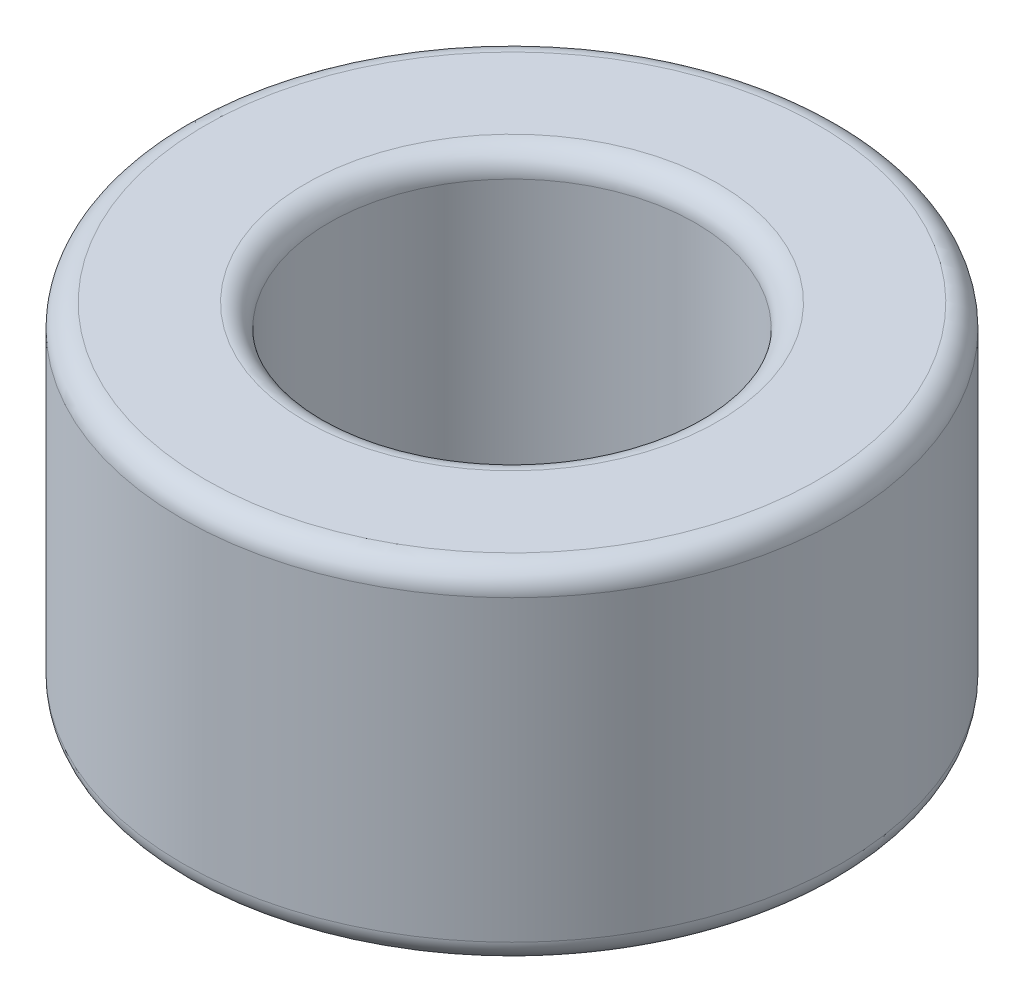
ISO-10303-21;
HEADER;
FILE_DESCRIPTION(('STEP AP214'),'2;1');
FILE_NAME('part.step','',(''),(''),'','','');
FILE_SCHEMA(('AUTOMOTIVE_DESIGN { 1 0 10303 214 1 1 1 1 }'));
ENDSEC;
DATA;
#1=APPLICATION_CONTEXT('core data for automotive mechanical design processes');
#2=APPLICATION_PROTOCOL_DEFINITION('international standard','automotive_design',2000,#1);
#3=PRODUCT_CONTEXT('',#1,'mechanical');
#4=PRODUCT('Part','Part','',(#3));
#5=PRODUCT_RELATED_PRODUCT_CATEGORY('part','',(#4));
#6=PRODUCT_DEFINITION_FORMATION('','',#4);
#7=PRODUCT_DEFINITION_CONTEXT('part definition',#1,'design');
#8=PRODUCT_DEFINITION('design','',#6,#7);
#9=PRODUCT_DEFINITION_SHAPE('','',#8);
#10=(LENGTH_UNIT() NAMED_UNIT(*) SI_UNIT(.MILLI.,.METRE.));
#11=(NAMED_UNIT(*) PLANE_ANGLE_UNIT() SI_UNIT($,.RADIAN.));
#12=(NAMED_UNIT(*) SI_UNIT($,.STERADIAN.) SOLID_ANGLE_UNIT());
#13=UNCERTAINTY_MEASURE_WITH_UNIT(LENGTH_MEASURE(1.E-05),#10,'distance_accuracy_value','');
#14=(GEOMETRIC_REPRESENTATION_CONTEXT(3) GLOBAL_UNCERTAINTY_ASSIGNED_CONTEXT((#13)) GLOBAL_UNIT_ASSIGNED_CONTEXT((#10,
#11,#12)) REPRESENTATION_CONTEXT('',''));
#15=CARTESIAN_POINT('',(0.,0.,0.));
#16=DIRECTION('',(0.,0.,1.));
#17=DIRECTION('',(1.,0.,0.));
#18=AXIS2_PLACEMENT_3D('',#15,#16,#17);
#19=CARTESIAN_POINT('',(0.,3.,0.));
#20=DIRECTION('',(0.,1.,0.));
#21=DIRECTION('',(0.,0.,1.));
#22=AXIS2_PLACEMENT_3D('',#19,#20,#21);
#23=PLANE('',#22);
#24=CARTESIAN_POINT('',(0.,3.,0.));
#25=DIRECTION('',(0.,1.,0.));
#26=DIRECTION('',(0.,0.,1.));
#27=AXIS2_PLACEMENT_3D('',#24,#25,#26);
#28=CIRCLE('',#27,1.7984375);
#29=CARTESIAN_POINT('',(0.,3.,1.7984375));
#30=VERTEX_POINT('',#29);
#31=EDGE_CURVE('E10',#30,#30,#28,.F.);
#32=ORIENTED_EDGE('',*,*,#31,.T.);
#33=EDGE_LOOP('',(#32));
#34=FACE_BOUND('',#33,.T.);
#35=CARTESIAN_POINT('',(0.,3.,0.));
#36=DIRECTION('',(0.,1.,0.));
#37=DIRECTION('',(0.,0.,1.));
#38=AXIS2_PLACEMENT_3D('',#35,#36,#37);
#39=CIRCLE('',#38,2.67656249999996);
#40=CARTESIAN_POINT('',(0.,3.,2.67656249999996));
#41=VERTEX_POINT('',#40);
#42=EDGE_CURVE('E47',#41,#41,#39,.T.);
#43=ORIENTED_EDGE('',*,*,#42,.T.);
#44=EDGE_LOOP('',(#43));
#45=FACE_BOUND('',#44,.T.);
#46=ADVANCED_FACE('F39',(#34,#45),#23,.T.);
#47=CARTESIAN_POINT('',(0.,0.,0.));
#48=DIRECTION('',(0.,1.,0.));
#49=DIRECTION('',(0.,0.,1.));
#50=AXIS2_PLACEMENT_3D('',#47,#48,#49);
#51=PLANE('',#50);
#52=CARTESIAN_POINT('',(0.,0.,0.));
#53=DIRECTION('',(0.,1.,0.));
#54=DIRECTION('',(0.,0.,1.));
#55=AXIS2_PLACEMENT_3D('',#52,#53,#54);
#56=CIRCLE('',#55,1.7984375);
#57=CARTESIAN_POINT('',(0.,0.,1.7984375));
#58=VERTEX_POINT('',#57);
#59=EDGE_CURVE('E72',#58,#58,#56,.T.);
#60=ORIENTED_EDGE('',*,*,#59,.T.);
#61=EDGE_LOOP('',(#60));
#62=FACE_BOUND('',#61,.T.);
#63=CARTESIAN_POINT('',(0.,0.,0.));
#64=DIRECTION('',(0.,1.,0.));
#65=DIRECTION('',(0.,0.,1.));
#66=AXIS2_PLACEMENT_3D('',#63,#64,#65);
#67=CIRCLE('',#66,2.67656249999996);
#68=CARTESIAN_POINT('',(0.,0.,2.67656249999996));
#69=VERTEX_POINT('',#68);
#70=EDGE_CURVE('E76',#69,#69,#67,.F.);
#71=ORIENTED_EDGE('',*,*,#70,.T.);
#72=EDGE_LOOP('',(#71));
#73=FACE_BOUND('',#72,.T.);
#74=ADVANCED_FACE('F80',(#62,#73),#51,.F.);
#75=CARTESIAN_POINT('',(0.,3.,0.));
#76=DIRECTION('',(0.,-1.,0.));
#77=DIRECTION('',(0.,0.,-1.));
#78=AXIS2_PLACEMENT_3D('',#75,#76,#77);
#79=CYLINDRICAL_SURFACE('',#78,2.87499999999996);
#80=CARTESIAN_POINT('',(0.,0.1984375,0.));
#81=DIRECTION('',(0.,1.,0.));
#82=DIRECTION('',(0.,0.,1.));
#83=AXIS2_PLACEMENT_3D('',#80,#81,#82);
#84=CIRCLE('',#83,2.87499999999996);
#85=CARTESIAN_POINT('',(0.,0.1984375,2.87499999999996));
#86=VERTEX_POINT('',#85);
#87=EDGE_CURVE('E54',#86,#86,#84,.T.);
#88=ORIENTED_EDGE('',*,*,#87,.T.);
#89=EDGE_LOOP('',(#88));
#90=FACE_BOUND('',#89,.T.);
#91=CARTESIAN_POINT('',(0.,2.8015625,0.));
#92=DIRECTION('',(0.,1.,0.));
#93=DIRECTION('',(0.,0.,1.));
#94=AXIS2_PLACEMENT_3D('',#91,#92,#93);
#95=CIRCLE('',#94,2.87499999999996);
#96=CARTESIAN_POINT('',(0.,2.8015625,2.87499999999996));
#97=VERTEX_POINT('',#96);
#98=EDGE_CURVE('E60',#97,#97,#95,.F.);
#99=ORIENTED_EDGE('',*,*,#98,.T.);
#100=EDGE_LOOP('',(#99));
#101=FACE_BOUND('',#100,.T.);
#102=ADVANCED_FACE('F90',(#90,#101),#79,.T.);
#103=CARTESIAN_POINT('',(0.,3.,0.));
#104=DIRECTION('',(0.,-1.,0.));
#105=DIRECTION('',(0.,0.,-1.));
#106=AXIS2_PLACEMENT_3D('',#103,#104,#105);
#107=CYLINDRICAL_SURFACE('',#106,1.6);
#108=CARTESIAN_POINT('',(0.,0.1984375,0.));
#109=DIRECTION('',(0.,1.,0.));
#110=DIRECTION('',(0.,0.,1.));
#111=AXIS2_PLACEMENT_3D('',#108,#109,#110);
#112=CIRCLE('',#111,1.6);
#113=CARTESIAN_POINT('',(0.,0.1984375,1.6));
#114=VERTEX_POINT('',#113);
#115=EDGE_CURVE('E65',#114,#114,#112,.F.);
#116=ORIENTED_EDGE('',*,*,#115,.T.);
#117=EDGE_LOOP('',(#116));
#118=FACE_BOUND('',#117,.T.);
#119=CARTESIAN_POINT('',(0.,2.8015625,0.));
#120=DIRECTION('',(0.,1.,0.));
#121=DIRECTION('',(0.,0.,1.));
#122=AXIS2_PLACEMENT_3D('',#119,#120,#121);
#123=CIRCLE('',#122,1.6);
#124=CARTESIAN_POINT('',(0.,2.8015625,1.6));
#125=VERTEX_POINT('',#124);
#126=EDGE_CURVE('E69',#125,#125,#123,.T.);
#127=ORIENTED_EDGE('',*,*,#126,.T.);
#128=EDGE_LOOP('',(#127));
#129=FACE_BOUND('',#128,.T.);
#130=ADVANCED_FACE('F93',(#118,#129),#107,.F.);
#131=CARTESIAN_POINT('',(0.,0.1984375,0.));
#132=DIRECTION('',(0.,1.,0.));
#133=DIRECTION('',(0.,0.,1.));
#134=AXIS2_PLACEMENT_3D('',#131,#132,#133);
#135=TOROIDAL_SURFACE('',#134,1.7984375,0.1984375);
#136=ORIENTED_EDGE('',*,*,#115,.F.);
#137=EDGE_LOOP('',(#136));
#138=FACE_BOUND('',#137,.T.);
#139=ORIENTED_EDGE('',*,*,#59,.F.);
#140=EDGE_LOOP('',(#139));
#141=FACE_BOUND('',#140,.T.);
#142=ADVANCED_FACE('F86',(#138,#141),#135,.T.);
#143=CARTESIAN_POINT('',(0.,0.1984375,0.));
#144=DIRECTION('',(0.,1.,0.));
#145=DIRECTION('',(0.,0.,1.));
#146=AXIS2_PLACEMENT_3D('',#143,#144,#145);
#147=TOROIDAL_SURFACE('',#146,2.67656249999996,0.1984375);
#148=ORIENTED_EDGE('',*,*,#70,.F.);
#149=EDGE_LOOP('',(#148));
#150=FACE_BOUND('',#149,.T.);
#151=ORIENTED_EDGE('',*,*,#87,.F.);
#152=EDGE_LOOP('',(#151));
#153=FACE_BOUND('',#152,.T.);
#154=ADVANCED_FACE('F82',(#150,#153),#147,.T.);
#155=CARTESIAN_POINT('',(0.,2.8015625,0.));
#156=DIRECTION('',(0.,1.,0.));
#157=DIRECTION('',(0.,0.,1.));
#158=AXIS2_PLACEMENT_3D('',#155,#156,#157);
#159=TOROIDAL_SURFACE('',#158,1.7984375,0.1984375);
#160=ORIENTED_EDGE('',*,*,#31,.F.);
#161=EDGE_LOOP('',(#160));
#162=FACE_BOUND('',#161,.T.);
#163=ORIENTED_EDGE('',*,*,#126,.F.);
#164=EDGE_LOOP('',(#163));
#165=FACE_BOUND('',#164,.T.);
#166=ADVANCED_FACE('F85',(#162,#165),#159,.T.);
#167=CARTESIAN_POINT('',(0.,2.8015625,0.));
#168=DIRECTION('',(0.,1.,0.));
#169=DIRECTION('',(0.,0.,1.));
#170=AXIS2_PLACEMENT_3D('',#167,#168,#169);
#171=TOROIDAL_SURFACE('',#170,2.67656249999996,0.1984375);
#172=ORIENTED_EDGE('',*,*,#98,.F.);
#173=EDGE_LOOP('',(#172));
#174=FACE_BOUND('',#173,.T.);
#175=ORIENTED_EDGE('',*,*,#42,.F.);
#176=EDGE_LOOP('',(#175));
#177=FACE_BOUND('',#176,.T.);
#178=ADVANCED_FACE('F41',(#174,#177),#171,.T.);
#179=CLOSED_SHELL('',(#46,#74,#102,#130,#142,#154,#166,#178));
#180=MANIFOLD_SOLID_BREP('B2',#179);
#181=ADVANCED_BREP_SHAPE_REPRESENTATION('',(#18,#180),#14);
#182=SHAPE_DEFINITION_REPRESENTATION(#9,#181);
ENDSEC;
END-ISO-10303-21;
